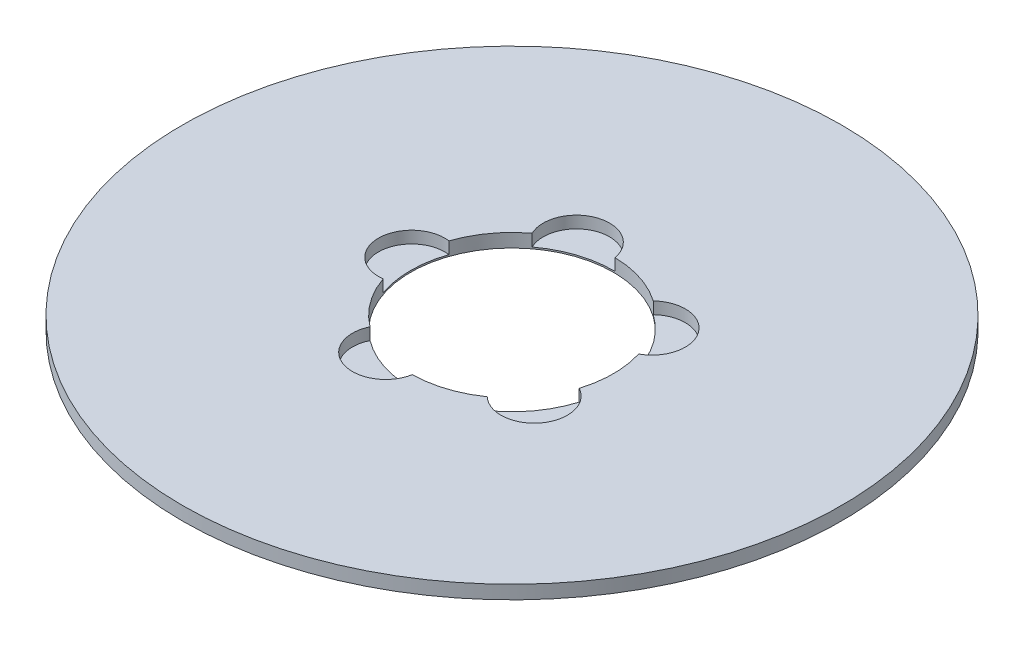
ISO-10303-21;
HEADER;
FILE_DESCRIPTION(('STEP AP214'),'2;1');
FILE_NAME('part.step','',(''),(''),'','','');
FILE_SCHEMA(('AUTOMOTIVE_DESIGN { 1 0 10303 214 1 1 1 1 }'));
ENDSEC;
DATA;
#1=APPLICATION_CONTEXT('core data for automotive mechanical design processes');
#2=APPLICATION_PROTOCOL_DEFINITION('international standard','automotive_design',2000,#1);
#3=PRODUCT_CONTEXT('',#1,'mechanical');
#4=PRODUCT('Part','Part','',(#3));
#5=PRODUCT_RELATED_PRODUCT_CATEGORY('part','',(#4));
#6=PRODUCT_DEFINITION_FORMATION('','',#4);
#7=PRODUCT_DEFINITION_CONTEXT('part definition',#1,'design');
#8=PRODUCT_DEFINITION('design','',#6,#7);
#9=PRODUCT_DEFINITION_SHAPE('','',#8);
#10=(LENGTH_UNIT() NAMED_UNIT(*) SI_UNIT(.MILLI.,.METRE.));
#11=(NAMED_UNIT(*) PLANE_ANGLE_UNIT() SI_UNIT($,.RADIAN.));
#12=(NAMED_UNIT(*) SI_UNIT($,.STERADIAN.) SOLID_ANGLE_UNIT());
#13=UNCERTAINTY_MEASURE_WITH_UNIT(LENGTH_MEASURE(1.E-05),#10,'distance_accuracy_value','');
#14=(GEOMETRIC_REPRESENTATION_CONTEXT(3) GLOBAL_UNCERTAINTY_ASSIGNED_CONTEXT((#13)) GLOBAL_UNIT_ASSIGNED_CONTEXT((#10,
#11,#12)) REPRESENTATION_CONTEXT('',''));
#15=CARTESIAN_POINT('',(0.,0.,0.));
#16=DIRECTION('',(0.,0.,1.));
#17=DIRECTION('',(1.,0.,0.));
#18=AXIS2_PLACEMENT_3D('',#15,#16,#17);
#19=CARTESIAN_POINT('',(0.,4.,0.));
#20=DIRECTION('',(0.,-1.,0.));
#21=DIRECTION('',(0.,0.,-1.));
#22=AXIS2_PLACEMENT_3D('',#19,#20,#21);
#23=CYLINDRICAL_SURFACE('',#22,97.5);
#24=CARTESIAN_POINT('',(0.,4.,0.));
#25=DIRECTION('',(0.,1.,0.));
#26=DIRECTION('',(0.,0.,1.));
#27=AXIS2_PLACEMENT_3D('',#24,#25,#26);
#28=CIRCLE('',#27,97.5);
#29=CARTESIAN_POINT('',(0.,4.,97.5));
#30=VERTEX_POINT('',#29);
#31=EDGE_CURVE('E157',#30,#30,#28,.T.);
#32=ORIENTED_EDGE('',*,*,#31,.F.);
#33=EDGE_LOOP('',(#32));
#34=FACE_BOUND('',#33,.T.);
#35=CARTESIAN_POINT('',(0.,0.,0.));
#36=DIRECTION('',(0.,1.,0.));
#37=DIRECTION('',(0.,0.,1.));
#38=AXIS2_PLACEMENT_3D('',#35,#36,#37);
#39=CIRCLE('',#38,97.5);
#40=CARTESIAN_POINT('',(0.,0.,97.5));
#41=VERTEX_POINT('',#40);
#42=EDGE_CURVE('E150',#41,#41,#39,.T.);
#43=ORIENTED_EDGE('',*,*,#42,.T.);
#44=EDGE_LOOP('',(#43));
#45=FACE_BOUND('',#44,.T.);
#46=ADVANCED_FACE('F39',(#34,#45),#23,.T.);
#47=CARTESIAN_POINT('',(0.,4.,0.));
#48=DIRECTION('',(0.,1.,0.));
#49=DIRECTION('',(0.,0.,1.));
#50=AXIS2_PLACEMENT_3D('',#47,#48,#49);
#51=PLANE('',#50);
#52=CARTESIAN_POINT('',(-9.17030708695887,4.,-28.2233031523738));
#53=DIRECTION('',(0.,1.,0.));
#54=DIRECTION('',(-0.95105651629515,0.,0.309016994374958));
#55=AXIS2_PLACEMENT_3D('',#52,#53,#54);
#56=CIRCLE('',#55,9.82339927558178);
#57=CARTESIAN_POINT('',(0.49182684238658,4.,-29.9959681683574));
#58=VERTEX_POINT('',#57);
#59=CARTESIAN_POINT('',(-18.029083991376,4.,-23.9781594462942));
#60=VERTEX_POINT('',#59);
#61=EDGE_CURVE('E194',#58,#60,#56,.T.);
#62=ORIENTED_EDGE('',*,*,#61,.F.);
#63=CARTESIAN_POINT('',(0.,4.,0.));
#64=DIRECTION('',(0.,1.,0.));
#65=DIRECTION('',(0.,0.,1.));
#66=AXIS2_PLACEMENT_3D('',#63,#64,#65);
#67=CIRCLE('',#66,30.);
#68=CARTESIAN_POINT('',(17.2332914438139,4.,-24.5563365755678));
#69=VERTEX_POINT('',#68);
#70=EDGE_CURVE('E147',#69,#58,#67,.T.);
#71=ORIENTED_EDGE('',*,*,#70,.F.);
#72=CARTESIAN_POINT('',(24.0081756409314,4.,-17.4429606229593));
#73=DIRECTION('',(0.,1.,0.));
#74=DIRECTION('',(-0.58778525229248,0.,-0.809016994374942));
#75=AXIS2_PLACEMENT_3D('',#72,#73,#74);
#76=CIRCLE('',#75,9.82339927558178);
#77=CARTESIAN_POINT('',(28.6798438416855,4.,-8.80150880341169));
#78=VERTEX_POINT('',#77);
#79=EDGE_CURVE('E254',#78,#69,#76,.T.);
#80=ORIENTED_EDGE('',*,*,#79,.F.);
#81=CARTESIAN_POINT('',(28.6798438416856,4.,8.80150880341128));
#82=VERTEX_POINT('',#81);
#83=EDGE_CURVE('E144',#82,#78,#67,.T.);
#84=ORIENTED_EDGE('',*,*,#83,.F.);
#85=CARTESIAN_POINT('',(24.0081756409316,4.,17.442960622959));
#86=DIRECTION('',(0.,1.,0.));
#87=DIRECTION('',(0.587785252292469,0.,-0.809016994374951));
#88=AXIS2_PLACEMENT_3D('',#85,#86,#87);
#89=CIRCLE('',#88,9.82339927558178);
#90=CARTESIAN_POINT('',(17.2332914438143,4.,24.5563365755676));
#91=VERTEX_POINT('',#90);
#92=EDGE_CURVE('E141',#91,#82,#89,.T.);
#93=ORIENTED_EDGE('',*,*,#92,.F.);
#94=CARTESIAN_POINT('',(0.491826842387005,4.,29.9959681683574));
#95=VERTEX_POINT('',#94);
#96=EDGE_CURVE('E134',#95,#91,#67,.T.);
#97=ORIENTED_EDGE('',*,*,#96,.F.);
#98=CARTESIAN_POINT('',(-9.17030708695847,4.,28.2233031523739));
#99=DIRECTION('',(0.,1.,0.));
#100=DIRECTION('',(0.951056516295155,0.,0.309016994374945));
#101=AXIS2_PLACEMENT_3D('',#98,#99,#100);
#102=CIRCLE('',#101,9.82339927558178);
#103=CARTESIAN_POINT('',(-18.0290839913756,4.,23.9781594462945));
#104=VERTEX_POINT('',#103);
#105=EDGE_CURVE('E111',#104,#95,#102,.T.);
#106=ORIENTED_EDGE('',*,*,#105,.F.);
#107=CARTESIAN_POINT('',(-28.3758781365109,4.,9.73701905009334));
#108=VERTEX_POINT('',#107);
#109=EDGE_CURVE('E145',#108,#104,#67,.T.);
#110=ORIENTED_EDGE('',*,*,#109,.F.);
#111=CARTESIAN_POINT('',(-29.6757371079459,4.,0.));
#112=DIRECTION('',(0.,1.,0.));
#113=DIRECTION('',(0.,0.,1.));
#114=AXIS2_PLACEMENT_3D('',#111,#112,#113);
#115=CIRCLE('',#114,9.82339927558178);
#116=CARTESIAN_POINT('',(-28.3758781365109,4.,-9.73701905009334));
#117=VERTEX_POINT('',#116);
#118=EDGE_CURVE('E153',#117,#108,#115,.T.);
#119=ORIENTED_EDGE('',*,*,#118,.F.);
#120=EDGE_CURVE('E146',#60,#117,#67,.T.);
#121=ORIENTED_EDGE('',*,*,#120,.F.);
#122=EDGE_LOOP('',(#62,#71,#80,#84,#93,#97,#106,#110,#119,#121));
#123=FACE_BOUND('',#122,.T.);
#124=ORIENTED_EDGE('',*,*,#31,.T.);
#125=EDGE_LOOP('',(#124));
#126=FACE_BOUND('',#125,.T.);
#127=ADVANCED_FACE('F139',(#123,#126),#51,.T.);
#128=CARTESIAN_POINT('',(0.,0.,0.));
#129=DIRECTION('',(0.,1.,0.));
#130=DIRECTION('',(0.,0.,1.));
#131=AXIS2_PLACEMENT_3D('',#128,#129,#130);
#132=PLANE('',#131);
#133=CARTESIAN_POINT('',(0.,0.,0.));
#134=DIRECTION('',(0.,1.,0.));
#135=DIRECTION('',(0.,0.,1.));
#136=AXIS2_PLACEMENT_3D('',#133,#134,#135);
#137=CIRCLE('',#136,30.);
#138=CARTESIAN_POINT('',(0.,0.,30.));
#139=VERTEX_POINT('',#138);
#140=EDGE_CURVE('E154',#139,#139,#137,.T.);
#141=ORIENTED_EDGE('',*,*,#140,.T.);
#142=EDGE_LOOP('',(#141));
#143=FACE_BOUND('',#142,.T.);
#144=ORIENTED_EDGE('',*,*,#42,.F.);
#145=EDGE_LOOP('',(#144));
#146=FACE_BOUND('',#145,.T.);
#147=ADVANCED_FACE('F213',(#143,#146),#132,.F.);
#148=CARTESIAN_POINT('',(0.,4.,0.));
#149=DIRECTION('',(0.,-1.,0.));
#150=DIRECTION('',(0.,0.,-1.));
#151=AXIS2_PLACEMENT_3D('',#148,#149,#150);
#152=CYLINDRICAL_SURFACE('',#151,30.);
#153=DIRECTION('',(0.,1.,0.));
#154=VECTOR('',#153,1.);
#155=CARTESIAN_POINT('',(0.491826842386581,2.23407240166298,-29.9959681683574));
#156=LINE('',#155,#154);
#157=CARTESIAN_POINT('',(0.49182684238658,0.468144803325962,-29.9959681683574));
#158=VERTEX_POINT('',#157);
#159=EDGE_CURVE('E11',#158,#58,#156,.T.);
#160=ORIENTED_EDGE('',*,*,#159,.F.);
#161=CARTESIAN_POINT('',(0.,0.468144803325962,0.));
#162=DIRECTION('',(0.,1.,0.));
#163=DIRECTION('',(0.,0.,1.));
#164=AXIS2_PLACEMENT_3D('',#161,#162,#163);
#165=CIRCLE('',#164,30.);
#166=CARTESIAN_POINT('',(-18.029083991376,0.468144803325962,-23.9781594462942));
#167=VERTEX_POINT('',#166);
#168=EDGE_CURVE('E189',#158,#167,#165,.T.);
#169=ORIENTED_EDGE('',*,*,#168,.T.);
#170=DIRECTION('',(0.,1.,0.));
#171=VECTOR('',#170,1.);
#172=CARTESIAN_POINT('',(-18.029083991376,2.23407240166298,-23.9781594462943));
#173=LINE('',#172,#171);
#174=EDGE_CURVE('E46',#60,#167,#173,.F.);
#175=ORIENTED_EDGE('',*,*,#174,.F.);
#176=ORIENTED_EDGE('',*,*,#120,.T.);
#177=DIRECTION('',(0.,1.,0.));
#178=VECTOR('',#177,1.);
#179=CARTESIAN_POINT('',(-28.3758781365109,2.23407240166298,-9.73701905009334));
#180=LINE('',#179,#178);
#181=CARTESIAN_POINT('',(-28.3758781365109,0.468144803325962,-9.73701905009334));
#182=VERTEX_POINT('',#181);
#183=EDGE_CURVE('E168',#182,#117,#180,.T.);
#184=ORIENTED_EDGE('',*,*,#183,.F.);
#185=CARTESIAN_POINT('',(0.,0.468144803325962,0.));
#186=DIRECTION('',(0.,1.,0.));
#187=DIRECTION('',(0.,0.,1.));
#188=AXIS2_PLACEMENT_3D('',#185,#186,#187);
#189=CIRCLE('',#188,30.);
#190=CARTESIAN_POINT('',(-28.3758781365109,0.468144803325962,9.73701905009334));
#191=VERTEX_POINT('',#190);
#192=EDGE_CURVE('E165',#182,#191,#189,.T.);
#193=ORIENTED_EDGE('',*,*,#192,.T.);
#194=DIRECTION('',(0.,1.,0.));
#195=VECTOR('',#194,1.);
#196=CARTESIAN_POINT('',(-28.3758781365109,2.23407240166298,9.73701905009334));
#197=LINE('',#196,#195);
#198=EDGE_CURVE('E170',#108,#191,#197,.F.);
#199=ORIENTED_EDGE('',*,*,#198,.F.);
#200=ORIENTED_EDGE('',*,*,#109,.T.);
#201=DIRECTION('',(0.,1.,0.));
#202=VECTOR('',#201,1.);
#203=CARTESIAN_POINT('',(-18.0290839913756,2.23407240166298,23.9781594462945));
#204=LINE('',#203,#202);
#205=CARTESIAN_POINT('',(-18.0290839913756,0.468144803325962,23.9781594462945));
#206=VERTEX_POINT('',#205);
#207=EDGE_CURVE('E121',#206,#104,#204,.T.);
#208=ORIENTED_EDGE('',*,*,#207,.F.);
#209=CARTESIAN_POINT('',(0.,0.468144803325962,0.));
#210=DIRECTION('',(0.,1.,0.));
#211=DIRECTION('',(0.,0.,1.));
#212=AXIS2_PLACEMENT_3D('',#209,#210,#211);
#213=CIRCLE('',#212,30.);
#214=CARTESIAN_POINT('',(0.491826842387005,0.468144803325962,29.9959681683574));
#215=VERTEX_POINT('',#214);
#216=EDGE_CURVE('E136',#206,#215,#213,.T.);
#217=ORIENTED_EDGE('',*,*,#216,.T.);
#218=DIRECTION('',(0.,1.,0.));
#219=VECTOR('',#218,1.);
#220=CARTESIAN_POINT('',(0.491826842387005,2.23407240166298,29.9959681683574));
#221=LINE('',#220,#219);
#222=EDGE_CURVE('E117',#95,#215,#221,.F.);
#223=ORIENTED_EDGE('',*,*,#222,.F.);
#224=ORIENTED_EDGE('',*,*,#96,.T.);
#225=DIRECTION('',(0.,1.,0.));
#226=VECTOR('',#225,1.);
#227=CARTESIAN_POINT('',(17.2332914438143,2.23407240166298,24.5563365755676));
#228=LINE('',#227,#226);
#229=CARTESIAN_POINT('',(17.2332914438143,0.468144803325962,24.5563365755676));
#230=VERTEX_POINT('',#229);
#231=EDGE_CURVE('E182',#230,#91,#228,.T.);
#232=ORIENTED_EDGE('',*,*,#231,.F.);
#233=CARTESIAN_POINT('',(0.,0.468144803325962,0.));
#234=DIRECTION('',(0.,1.,0.));
#235=DIRECTION('',(0.,0.,1.));
#236=AXIS2_PLACEMENT_3D('',#233,#234,#235);
#237=CIRCLE('',#236,30.);
#238=CARTESIAN_POINT('',(28.6798438416856,0.468144803325962,8.80150880341128));
#239=VERTEX_POINT('',#238);
#240=EDGE_CURVE('E174',#230,#239,#237,.T.);
#241=ORIENTED_EDGE('',*,*,#240,.T.);
#242=DIRECTION('',(0.,1.,0.));
#243=VECTOR('',#242,1.);
#244=CARTESIAN_POINT('',(28.6798438416856,2.23407240166298,8.80150880341127));
#245=LINE('',#244,#243);
#246=EDGE_CURVE('E177',#82,#239,#245,.F.);
#247=ORIENTED_EDGE('',*,*,#246,.F.);
#248=ORIENTED_EDGE('',*,*,#83,.T.);
#249=DIRECTION('',(0.,1.,0.));
#250=VECTOR('',#249,1.);
#251=CARTESIAN_POINT('',(28.6798438416855,2.23407240166298,-8.80150880341169));
#252=LINE('',#251,#250);
#253=CARTESIAN_POINT('',(28.6798438416855,0.468144803325962,-8.80150880341169));
#254=VERTEX_POINT('',#253);
#255=EDGE_CURVE('E187',#254,#78,#252,.T.);
#256=ORIENTED_EDGE('',*,*,#255,.F.);
#257=CARTESIAN_POINT('',(0.,0.468144803325962,0.));
#258=DIRECTION('',(0.,1.,0.));
#259=DIRECTION('',(0.,0.,1.));
#260=AXIS2_PLACEMENT_3D('',#257,#258,#259);
#261=CIRCLE('',#260,30.);
#262=CARTESIAN_POINT('',(17.2332914438139,0.468144803325962,-24.5563365755678));
#263=VERTEX_POINT('',#262);
#264=EDGE_CURVE('E181',#254,#263,#261,.T.);
#265=ORIENTED_EDGE('',*,*,#264,.T.);
#266=DIRECTION('',(0.,1.,0.));
#267=VECTOR('',#266,1.);
#268=CARTESIAN_POINT('',(17.2332914438139,2.23407240166298,-24.5563365755678));
#269=LINE('',#268,#267);
#270=EDGE_CURVE('E186',#69,#263,#269,.F.);
#271=ORIENTED_EDGE('',*,*,#270,.F.);
#272=ORIENTED_EDGE('',*,*,#70,.T.);
#273=EDGE_LOOP('',(#160,#169,#175,#176,#184,#193,#199,#200,#208,#217,#223,#224,#232,#241,#247,
#248,#256,#265,#271,#272));
#274=FACE_BOUND('',#273,.T.);
#275=ORIENTED_EDGE('',*,*,#140,.F.);
#276=EDGE_LOOP('',(#275));
#277=FACE_BOUND('',#276,.T.);
#278=ADVANCED_FACE('F135',(#274,#277),#152,.F.);
#279=CARTESIAN_POINT('',(-29.6757371079459,0.468144803325962,0.));
#280=DIRECTION('',(0.,1.,0.));
#281=DIRECTION('',(0.,0.,1.));
#282=AXIS2_PLACEMENT_3D('',#279,#280,#281);
#283=CYLINDRICAL_SURFACE('',#282,9.82339927558178);
#284=ORIENTED_EDGE('',*,*,#183,.T.);
#285=ORIENTED_EDGE('',*,*,#118,.T.);
#286=ORIENTED_EDGE('',*,*,#198,.T.);
#287=CARTESIAN_POINT('',(-29.6757371079459,0.468144803325962,0.));
#288=DIRECTION('',(0.,1.,0.));
#289=DIRECTION('',(0.,0.,1.));
#290=AXIS2_PLACEMENT_3D('',#287,#288,#289);
#291=CIRCLE('',#290,9.82339927558178);
#292=EDGE_CURVE('E158',#182,#191,#291,.T.);
#293=ORIENTED_EDGE('',*,*,#292,.F.);
#294=EDGE_LOOP('',(#284,#285,#286,#293));
#295=FACE_BOUND('',#294,.T.);
#296=ADVANCED_FACE('F221',(#295),#283,.F.);
#297=CARTESIAN_POINT('',(-29.6757371079459,0.468144803325962,0.));
#298=DIRECTION('',(0.,1.,0.));
#299=DIRECTION('',(0.,0.,1.));
#300=AXIS2_PLACEMENT_3D('',#297,#298,#299);
#301=PLANE('',#300);
#302=ORIENTED_EDGE('',*,*,#292,.T.);
#303=ORIENTED_EDGE('',*,*,#192,.F.);
#304=EDGE_LOOP('',(#302,#303));
#305=FACE_BOUND('',#304,.T.);
#306=ADVANCED_FACE('F227',(#305),#301,.T.);
#307=CARTESIAN_POINT('',(-9.17030708695847,0.468144803325962,28.2233031523739));
#308=DIRECTION('',(0.,1.,0.));
#309=DIRECTION('',(0.,0.,1.));
#310=AXIS2_PLACEMENT_3D('',#307,#308,#309);
#311=CYLINDRICAL_SURFACE('',#310,9.82339927558178);
#312=ORIENTED_EDGE('',*,*,#207,.T.);
#313=ORIENTED_EDGE('',*,*,#105,.T.);
#314=ORIENTED_EDGE('',*,*,#222,.T.);
#315=CARTESIAN_POINT('',(-9.17030708695847,0.468144803325962,28.2233031523739));
#316=DIRECTION('',(0.,1.,0.));
#317=DIRECTION('',(0.951056516295155,0.,0.309016994374945));
#318=AXIS2_PLACEMENT_3D('',#315,#316,#317);
#319=CIRCLE('',#318,9.82339927558178);
#320=EDGE_CURVE('E127',#206,#215,#319,.T.);
#321=ORIENTED_EDGE('',*,*,#320,.F.);
#322=EDGE_LOOP('',(#312,#313,#314,#321));
#323=FACE_BOUND('',#322,.T.);
#324=ADVANCED_FACE('F116',(#323),#311,.F.);
#325=CARTESIAN_POINT('',(-9.17030708695847,0.468144803325962,28.2233031523739));
#326=DIRECTION('',(0.,1.,0.));
#327=DIRECTION('',(0.951056516295155,0.,0.309016994374945));
#328=AXIS2_PLACEMENT_3D('',#325,#326,#327);
#329=PLANE('',#328);
#330=ORIENTED_EDGE('',*,*,#320,.T.);
#331=ORIENTED_EDGE('',*,*,#216,.F.);
#332=EDGE_LOOP('',(#330,#331));
#333=FACE_BOUND('',#332,.T.);
#334=ADVANCED_FACE('F234',(#333),#329,.T.);
#335=CARTESIAN_POINT('',(24.0081756409316,0.468144803325962,17.442960622959));
#336=DIRECTION('',(0.,1.,0.));
#337=DIRECTION('',(0.,0.,1.));
#338=AXIS2_PLACEMENT_3D('',#335,#336,#337);
#339=CYLINDRICAL_SURFACE('',#338,9.82339927558178);
#340=ORIENTED_EDGE('',*,*,#231,.T.);
#341=ORIENTED_EDGE('',*,*,#92,.T.);
#342=ORIENTED_EDGE('',*,*,#246,.T.);
#343=CARTESIAN_POINT('',(24.0081756409316,0.468144803325962,17.442960622959));
#344=DIRECTION('',(0.,1.,0.));
#345=DIRECTION('',(0.587785252292469,0.,-0.809016994374951));
#346=AXIS2_PLACEMENT_3D('',#343,#344,#345);
#347=CIRCLE('',#346,9.82339927558178);
#348=EDGE_CURVE('E130',#230,#239,#347,.T.);
#349=ORIENTED_EDGE('',*,*,#348,.F.);
#350=EDGE_LOOP('',(#340,#341,#342,#349));
#351=FACE_BOUND('',#350,.T.);
#352=ADVANCED_FACE('F240',(#351),#339,.F.);
#353=CARTESIAN_POINT('',(24.0081756409316,0.468144803325962,17.442960622959));
#354=DIRECTION('',(0.,1.,0.));
#355=DIRECTION('',(0.587785252292469,0.,-0.809016994374951));
#356=AXIS2_PLACEMENT_3D('',#353,#354,#355);
#357=PLANE('',#356);
#358=ORIENTED_EDGE('',*,*,#348,.T.);
#359=ORIENTED_EDGE('',*,*,#240,.F.);
#360=EDGE_LOOP('',(#358,#359));
#361=FACE_BOUND('',#360,.T.);
#362=ADVANCED_FACE('F245',(#361),#357,.T.);
#363=CARTESIAN_POINT('',(24.0081756409314,0.468144803325962,-17.4429606229593));
#364=DIRECTION('',(0.,1.,0.));
#365=DIRECTION('',(0.,0.,1.));
#366=AXIS2_PLACEMENT_3D('',#363,#364,#365);
#367=CYLINDRICAL_SURFACE('',#366,9.82339927558178);
#368=ORIENTED_EDGE('',*,*,#255,.T.);
#369=ORIENTED_EDGE('',*,*,#79,.T.);
#370=ORIENTED_EDGE('',*,*,#270,.T.);
#371=CARTESIAN_POINT('',(24.0081756409314,0.468144803325962,-17.4429606229593));
#372=DIRECTION('',(0.,1.,0.));
#373=DIRECTION('',(-0.58778525229248,0.,-0.809016994374942));
#374=AXIS2_PLACEMENT_3D('',#371,#372,#373);
#375=CIRCLE('',#374,9.82339927558178);
#376=EDGE_CURVE('E56',#254,#263,#375,.T.);
#377=ORIENTED_EDGE('',*,*,#376,.F.);
#378=EDGE_LOOP('',(#368,#369,#370,#377));
#379=FACE_BOUND('',#378,.T.);
#380=ADVANCED_FACE('F266',(#379),#367,.F.);
#381=CARTESIAN_POINT('',(24.0081756409314,0.468144803325962,-17.4429606229593));
#382=DIRECTION('',(0.,1.,0.));
#383=DIRECTION('',(-0.58778525229248,0.,-0.809016994374942));
#384=AXIS2_PLACEMENT_3D('',#381,#382,#383);
#385=PLANE('',#384);
#386=ORIENTED_EDGE('',*,*,#376,.T.);
#387=ORIENTED_EDGE('',*,*,#264,.F.);
#388=EDGE_LOOP('',(#386,#387));
#389=FACE_BOUND('',#388,.T.);
#390=ADVANCED_FACE('F204',(#389),#385,.T.);
#391=CARTESIAN_POINT('',(-9.17030708695887,0.468144803325962,-28.2233031523738));
#392=DIRECTION('',(0.,1.,0.));
#393=DIRECTION('',(0.,0.,1.));
#394=AXIS2_PLACEMENT_3D('',#391,#392,#393);
#395=CYLINDRICAL_SURFACE('',#394,9.82339927558178);
#396=ORIENTED_EDGE('',*,*,#159,.T.);
#397=ORIENTED_EDGE('',*,*,#61,.T.);
#398=ORIENTED_EDGE('',*,*,#174,.T.);
#399=CARTESIAN_POINT('',(-9.17030708695887,0.468144803325962,-28.2233031523738));
#400=DIRECTION('',(0.,1.,0.));
#401=DIRECTION('',(-0.95105651629515,0.,0.309016994374958));
#402=AXIS2_PLACEMENT_3D('',#399,#400,#401);
#403=CIRCLE('',#402,9.82339927558178);
#404=EDGE_CURVE('E55',#158,#167,#403,.T.);
#405=ORIENTED_EDGE('',*,*,#404,.F.);
#406=EDGE_LOOP('',(#396,#397,#398,#405));
#407=FACE_BOUND('',#406,.T.);
#408=ADVANCED_FACE('F193',(#407),#395,.F.);
#409=CARTESIAN_POINT('',(-9.17030708695887,0.468144803325962,-28.2233031523738));
#410=DIRECTION('',(0.,1.,0.));
#411=DIRECTION('',(-0.95105651629515,0.,0.309016994374958));
#412=AXIS2_PLACEMENT_3D('',#409,#410,#411);
#413=PLANE('',#412);
#414=ORIENTED_EDGE('',*,*,#404,.T.);
#415=ORIENTED_EDGE('',*,*,#168,.F.);
#416=EDGE_LOOP('',(#414,#415));
#417=FACE_BOUND('',#416,.T.);
#418=ADVANCED_FACE('F196',(#417),#413,.T.);
#419=CLOSED_SHELL('',(#46,#127,#147,#278,#296,#306,#324,#334,#352,#362,#380,#390,#408,#418));
#420=MANIFOLD_SOLID_BREP('B2',#419);
#421=ADVANCED_BREP_SHAPE_REPRESENTATION('',(#18,#420),#14);
#422=SHAPE_DEFINITION_REPRESENTATION(#9,#421);
ENDSEC;
END-ISO-10303-21;
